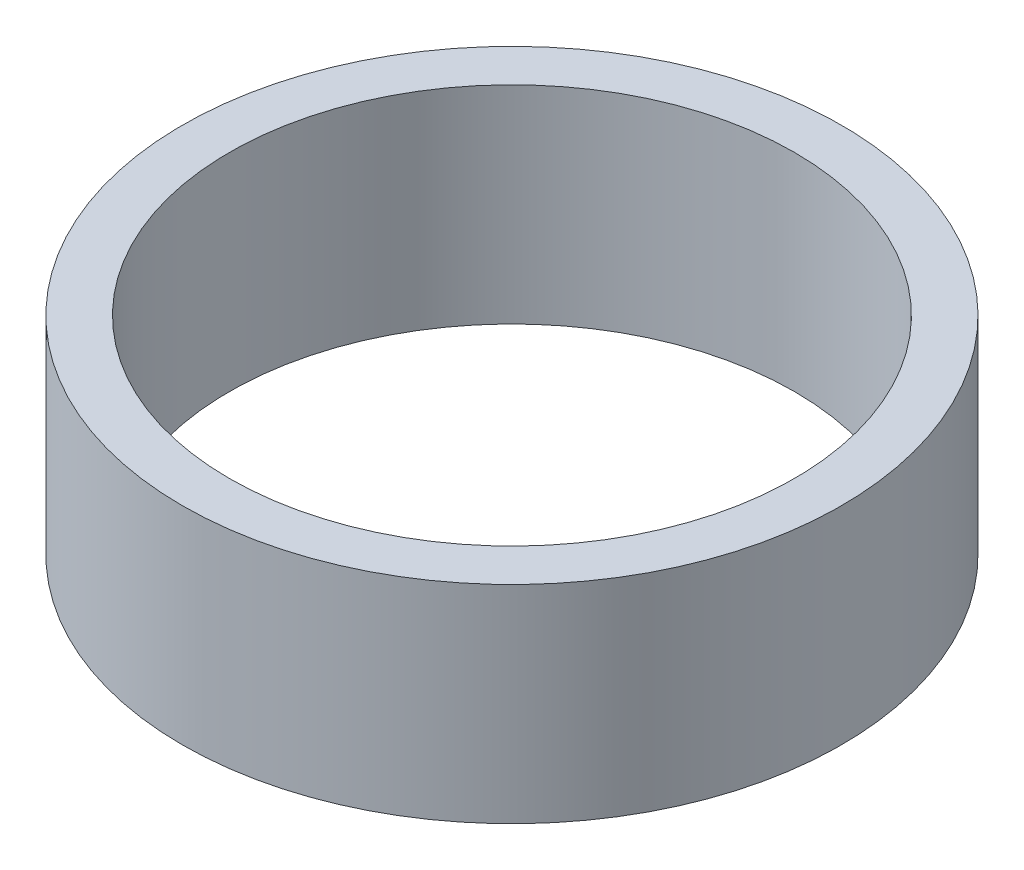
ISO-10303-21;
HEADER;
FILE_DESCRIPTION(('STEP AP214'),'2;1');
FILE_NAME('part.step','',(''),(''),'','','');
FILE_SCHEMA(('AUTOMOTIVE_DESIGN { 1 0 10303 214 1 1 1 1 }'));
ENDSEC;
DATA;
#1=APPLICATION_CONTEXT('core data for automotive mechanical design processes');
#2=APPLICATION_PROTOCOL_DEFINITION('international standard','automotive_design',2000,#1);
#3=PRODUCT_CONTEXT('',#1,'mechanical');
#4=PRODUCT('Part','Part','',(#3));
#5=PRODUCT_RELATED_PRODUCT_CATEGORY('part','',(#4));
#6=PRODUCT_DEFINITION_FORMATION('','',#4);
#7=PRODUCT_DEFINITION_CONTEXT('part definition',#1,'design');
#8=PRODUCT_DEFINITION('design','',#6,#7);
#9=PRODUCT_DEFINITION_SHAPE('','',#8);
#10=(LENGTH_UNIT() NAMED_UNIT(*) SI_UNIT(.MILLI.,.METRE.));
#11=(NAMED_UNIT(*) PLANE_ANGLE_UNIT() SI_UNIT($,.RADIAN.));
#12=(NAMED_UNIT(*) SI_UNIT($,.STERADIAN.) SOLID_ANGLE_UNIT());
#13=UNCERTAINTY_MEASURE_WITH_UNIT(LENGTH_MEASURE(1.E-05),#10,'distance_accuracy_value','');
#14=(GEOMETRIC_REPRESENTATION_CONTEXT(3) GLOBAL_UNCERTAINTY_ASSIGNED_CONTEXT((#13)) GLOBAL_UNIT_ASSIGNED_CONTEXT((#10,
#11,#12)) REPRESENTATION_CONTEXT('',''));
#15=CARTESIAN_POINT('',(0.,0.,0.));
#16=DIRECTION('',(0.,0.,1.));
#17=DIRECTION('',(1.,0.,0.));
#18=AXIS2_PLACEMENT_3D('',#15,#16,#17);
#19=CARTESIAN_POINT('',(0.,4.4,0.));
#20=DIRECTION('',(0.,1.,0.));
#21=DIRECTION('',(0.,0.,1.));
#22=AXIS2_PLACEMENT_3D('',#19,#20,#21);
#23=PLANE('',#22);
#24=CARTESIAN_POINT('',(0.,4.4,0.));
#25=DIRECTION('',(0.,1.,0.));
#26=DIRECTION('',(0.,0.,1.));
#27=AXIS2_PLACEMENT_3D('',#24,#25,#26);
#28=CIRCLE('',#27,7.);
#29=CARTESIAN_POINT('',(0.,4.4,7.));
#30=VERTEX_POINT('',#29);
#31=EDGE_CURVE('E10',#30,#30,#28,.T.);
#32=ORIENTED_EDGE('',*,*,#31,.T.);
#33=EDGE_LOOP('',(#32));
#34=FACE_BOUND('',#33,.T.);
#35=CARTESIAN_POINT('',(0.,4.4,0.));
#36=DIRECTION('',(0.,1.,0.));
#37=DIRECTION('',(0.,0.,1.));
#38=AXIS2_PLACEMENT_3D('',#35,#36,#37);
#39=CIRCLE('',#38,6.);
#40=CARTESIAN_POINT('',(0.,4.4,6.));
#41=VERTEX_POINT('',#40);
#42=EDGE_CURVE('E56',#41,#41,#39,.T.);
#43=ORIENTED_EDGE('',*,*,#42,.F.);
#44=EDGE_LOOP('',(#43));
#45=FACE_BOUND('',#44,.T.);
#46=ADVANCED_FACE('F43',(#34,#45),#23,.T.);
#47=CARTESIAN_POINT('',(0.,0.,0.));
#48=DIRECTION('',(0.,1.,0.));
#49=DIRECTION('',(0.,0.,1.));
#50=AXIS2_PLACEMENT_3D('',#47,#48,#49);
#51=PLANE('',#50);
#52=CARTESIAN_POINT('',(0.,0.,0.));
#53=DIRECTION('',(0.,1.,0.));
#54=DIRECTION('',(0.,0.,1.));
#55=AXIS2_PLACEMENT_3D('',#52,#53,#54);
#56=CIRCLE('',#55,7.);
#57=CARTESIAN_POINT('',(0.,0.,7.));
#58=VERTEX_POINT('',#57);
#59=EDGE_CURVE('E47',#58,#58,#56,.T.);
#60=ORIENTED_EDGE('',*,*,#59,.F.);
#61=EDGE_LOOP('',(#60));
#62=FACE_BOUND('',#61,.T.);
#63=CARTESIAN_POINT('',(0.,0.,0.));
#64=DIRECTION('',(0.,1.,0.));
#65=DIRECTION('',(0.,0.,1.));
#66=AXIS2_PLACEMENT_3D('',#63,#64,#65);
#67=CIRCLE('',#66,6.);
#68=CARTESIAN_POINT('',(0.,0.,6.));
#69=VERTEX_POINT('',#68);
#70=EDGE_CURVE('E58',#69,#69,#67,.T.);
#71=ORIENTED_EDGE('',*,*,#70,.T.);
#72=EDGE_LOOP('',(#71));
#73=FACE_BOUND('',#72,.T.);
#74=ADVANCED_FACE('F70',(#62,#73),#51,.F.);
#75=CARTESIAN_POINT('',(0.,4.4,0.));
#76=DIRECTION('',(0.,-1.,0.));
#77=DIRECTION('',(0.,0.,-1.));
#78=AXIS2_PLACEMENT_3D('',#75,#76,#77);
#79=CYLINDRICAL_SURFACE('',#78,7.);
#80=ORIENTED_EDGE('',*,*,#31,.F.);
#81=EDGE_LOOP('',(#80));
#82=FACE_BOUND('',#81,.T.);
#83=ORIENTED_EDGE('',*,*,#59,.T.);
#84=EDGE_LOOP('',(#83));
#85=FACE_BOUND('',#84,.T.);
#86=ADVANCED_FACE('F45',(#82,#85),#79,.T.);
#87=CARTESIAN_POINT('',(0.,4.4,0.));
#88=DIRECTION('',(0.,-1.,0.));
#89=DIRECTION('',(0.,0.,-1.));
#90=AXIS2_PLACEMENT_3D('',#87,#88,#89);
#91=CYLINDRICAL_SURFACE('',#90,6.);
#92=ORIENTED_EDGE('',*,*,#42,.T.);
#93=EDGE_LOOP('',(#92));
#94=FACE_BOUND('',#93,.T.);
#95=ORIENTED_EDGE('',*,*,#70,.F.);
#96=EDGE_LOOP('',(#95));
#97=FACE_BOUND('',#96,.T.);
#98=ADVANCED_FACE('F66',(#94,#97),#91,.F.);
#99=CLOSED_SHELL('',(#46,#74,#86,#98));
#100=MANIFOLD_SOLID_BREP('B2',#99);
#101=ADVANCED_BREP_SHAPE_REPRESENTATION('',(#18,#100),#14);
#102=SHAPE_DEFINITION_REPRESENTATION(#9,#101);
ENDSEC;
END-ISO-10303-21;
